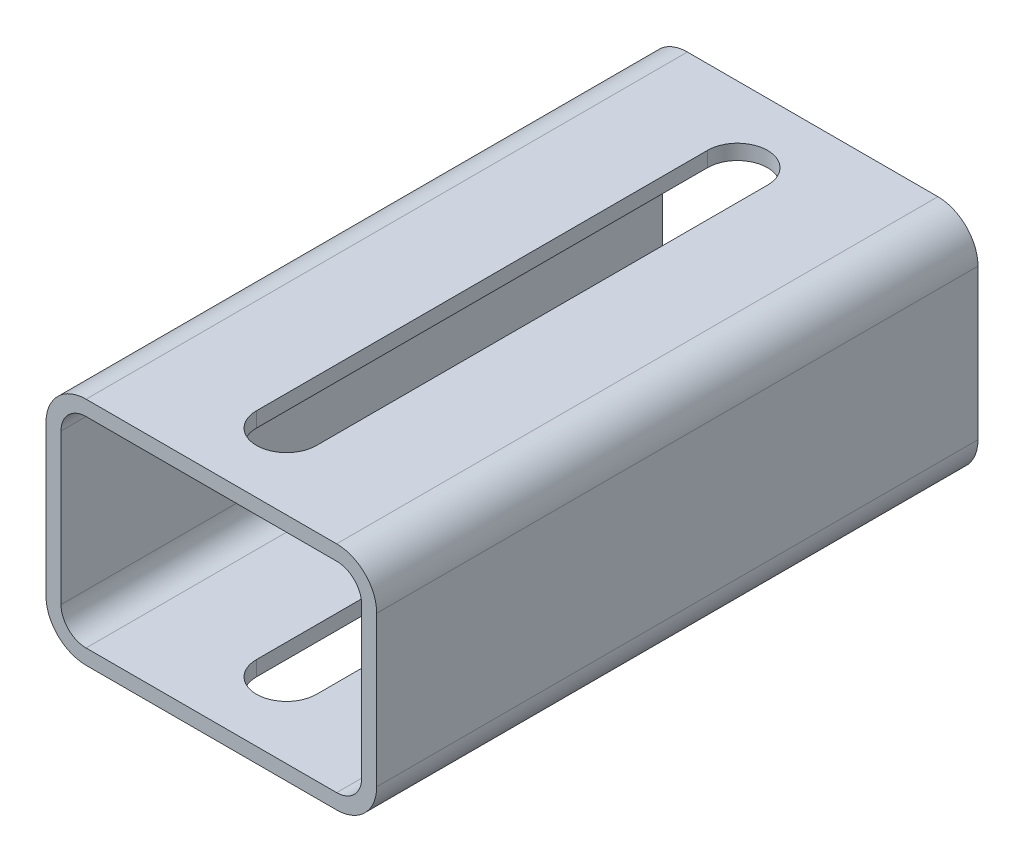
ISO-10303-21;
HEADER;
FILE_DESCRIPTION(('STEP AP214'),'2;1');
FILE_NAME('part.step','',(''),(''),'','','');
FILE_SCHEMA(('AUTOMOTIVE_DESIGN { 1 0 10303 214 1 1 1 1 }'));
ENDSEC;
DATA;
#1=APPLICATION_CONTEXT('core data for automotive mechanical design processes');
#2=APPLICATION_PROTOCOL_DEFINITION('international standard','automotive_design',2000,#1);
#3=PRODUCT_CONTEXT('',#1,'mechanical');
#4=PRODUCT('Part','Part','',(#3));
#5=PRODUCT_RELATED_PRODUCT_CATEGORY('part','',(#4));
#6=PRODUCT_DEFINITION_FORMATION('','',#4);
#7=PRODUCT_DEFINITION_CONTEXT('part definition',#1,'design');
#8=PRODUCT_DEFINITION('design','',#6,#7);
#9=PRODUCT_DEFINITION_SHAPE('','',#8);
#10=(LENGTH_UNIT() NAMED_UNIT(*) SI_UNIT(.MILLI.,.METRE.));
#11=(NAMED_UNIT(*) PLANE_ANGLE_UNIT() SI_UNIT($,.RADIAN.));
#12=(NAMED_UNIT(*) SI_UNIT($,.STERADIAN.) SOLID_ANGLE_UNIT());
#13=UNCERTAINTY_MEASURE_WITH_UNIT(LENGTH_MEASURE(1.E-05),#10,'distance_accuracy_value','');
#14=(GEOMETRIC_REPRESENTATION_CONTEXT(3) GLOBAL_UNCERTAINTY_ASSIGNED_CONTEXT((#13)) GLOBAL_UNIT_ASSIGNED_CONTEXT((#10,
#11,#12)) REPRESENTATION_CONTEXT('',''));
#15=CARTESIAN_POINT('',(0.,0.,0.));
#16=DIRECTION('',(0.,0.,1.));
#17=DIRECTION('',(1.,0.,0.));
#18=AXIS2_PLACEMENT_3D('',#15,#16,#17);
#19=CARTESIAN_POINT('',(-25.,-15.,60.));
#20=DIRECTION('',(0.,0.,1.));
#21=DIRECTION('',(1.,0.,0.));
#22=AXIS2_PLACEMENT_3D('',#19,#20,#21);
#23=PLANE('',#22);
#24=CARTESIAN_POINT('',(-25.,-15.,60.));
#25=DIRECTION('',(0.,0.,1.));
#26=DIRECTION('',(1.,0.,0.));
#27=AXIS2_PLACEMENT_3D('',#24,#25,#26);
#28=CIRCLE('',#27,8.);
#29=CARTESIAN_POINT('',(-33.,-15.,60.));
#30=VERTEX_POINT('',#29);
#31=CARTESIAN_POINT('',(-25.,-23.,60.));
#32=VERTEX_POINT('',#31);
#33=EDGE_CURVE('E403',#30,#32,#28,.T.);
#34=ORIENTED_EDGE('',*,*,#33,.T.);
#35=DIRECTION('',(1.,0.,0.));
#36=VECTOR('',#35,1.);
#37=CARTESIAN_POINT('',(25.,-23.,60.));
#38=LINE('',#37,#36);
#39=CARTESIAN_POINT('',(25.,-23.,60.));
#40=VERTEX_POINT('',#39);
#41=EDGE_CURVE('E407',#32,#40,#38,.T.);
#42=ORIENTED_EDGE('',*,*,#41,.T.);
#43=CARTESIAN_POINT('',(25.,-15.,60.));
#44=DIRECTION('',(0.,0.,1.));
#45=DIRECTION('',(1.,0.,0.));
#46=AXIS2_PLACEMENT_3D('',#43,#44,#45);
#47=CIRCLE('',#46,8.);
#48=CARTESIAN_POINT('',(33.,-15.,60.));
#49=VERTEX_POINT('',#48);
#50=EDGE_CURVE('E411',#40,#49,#47,.T.);
#51=ORIENTED_EDGE('',*,*,#50,.T.);
#52=DIRECTION('',(0.,1.,0.));
#53=VECTOR('',#52,1.);
#54=CARTESIAN_POINT('',(33.,-15.,60.));
#55=LINE('',#54,#53);
#56=CARTESIAN_POINT('',(33.,15.,60.));
#57=VERTEX_POINT('',#56);
#58=EDGE_CURVE('E414',#49,#57,#55,.T.);
#59=ORIENTED_EDGE('',*,*,#58,.T.);
#60=CARTESIAN_POINT('',(25.,15.,60.));
#61=DIRECTION('',(0.,0.,1.));
#62=DIRECTION('',(1.,0.,0.));
#63=AXIS2_PLACEMENT_3D('',#60,#61,#62);
#64=CIRCLE('',#63,8.);
#65=CARTESIAN_POINT('',(25.,23.,60.));
#66=VERTEX_POINT('',#65);
#67=EDGE_CURVE('E417',#57,#66,#64,.T.);
#68=ORIENTED_EDGE('',*,*,#67,.T.);
#69=DIRECTION('',(-1.,0.,0.));
#70=VECTOR('',#69,1.);
#71=CARTESIAN_POINT('',(25.,23.,60.));
#72=LINE('',#71,#70);
#73=CARTESIAN_POINT('',(-25.,23.,60.));
#74=VERTEX_POINT('',#73);
#75=EDGE_CURVE('E420',#66,#74,#72,.T.);
#76=ORIENTED_EDGE('',*,*,#75,.T.);
#77=CARTESIAN_POINT('',(-25.,15.,60.));
#78=DIRECTION('',(0.,0.,1.));
#79=DIRECTION('',(1.,0.,0.));
#80=AXIS2_PLACEMENT_3D('',#77,#78,#79);
#81=CIRCLE('',#80,8.);
#82=CARTESIAN_POINT('',(-33.,15.,60.));
#83=VERTEX_POINT('',#82);
#84=EDGE_CURVE('E423',#74,#83,#81,.T.);
#85=ORIENTED_EDGE('',*,*,#84,.T.);
#86=DIRECTION('',(0.,-1.,0.));
#87=VECTOR('',#86,1.);
#88=CARTESIAN_POINT('',(-33.,-15.,60.));
#89=LINE('',#88,#87);
#90=EDGE_CURVE('E426',#83,#30,#89,.T.);
#91=ORIENTED_EDGE('',*,*,#90,.T.);
#92=EDGE_LOOP('',(#34,#42,#51,#59,#68,#76,#85,#91));
#93=FACE_BOUND('',#92,.T.);
#94=DIRECTION('',(1.,0.,0.));
#95=VECTOR('',#94,1.);
#96=CARTESIAN_POINT('',(25.,-20.,60.));
#97=LINE('',#96,#95);
#98=CARTESIAN_POINT('',(-25.,-20.,60.));
#99=VERTEX_POINT('',#98);
#100=CARTESIAN_POINT('',(25.,-20.,60.));
#101=VERTEX_POINT('',#100);
#102=EDGE_CURVE('E323',#99,#101,#97,.T.);
#103=ORIENTED_EDGE('',*,*,#102,.F.);
#104=CARTESIAN_POINT('',(-25.,-15.,60.));
#105=DIRECTION('',(0.,0.,1.));
#106=DIRECTION('',(1.,0.,0.));
#107=AXIS2_PLACEMENT_3D('',#104,#105,#106);
#108=CIRCLE('',#107,5.);
#109=CARTESIAN_POINT('',(-30.,-15.,60.));
#110=VERTEX_POINT('',#109);
#111=EDGE_CURVE('E320',#110,#99,#108,.T.);
#112=ORIENTED_EDGE('',*,*,#111,.F.);
#113=DIRECTION('',(0.,-1.,0.));
#114=VECTOR('',#113,1.);
#115=CARTESIAN_POINT('',(-30.,-15.,60.));
#116=LINE('',#115,#114);
#117=CARTESIAN_POINT('',(-30.,15.,60.));
#118=VERTEX_POINT('',#117);
#119=EDGE_CURVE('E343',#118,#110,#116,.T.);
#120=ORIENTED_EDGE('',*,*,#119,.F.);
#121=CARTESIAN_POINT('',(-25.,15.,60.));
#122=DIRECTION('',(0.,0.,1.));
#123=DIRECTION('',(-1.,0.,0.));
#124=AXIS2_PLACEMENT_3D('',#121,#122,#123);
#125=CIRCLE('',#124,5.);
#126=CARTESIAN_POINT('',(-25.,20.,60.));
#127=VERTEX_POINT('',#126);
#128=EDGE_CURVE('E339',#127,#118,#125,.T.);
#129=ORIENTED_EDGE('',*,*,#128,.F.);
#130=DIRECTION('',(-1.,0.,0.));
#131=VECTOR('',#130,1.);
#132=CARTESIAN_POINT('',(25.,20.,60.));
#133=LINE('',#132,#131);
#134=CARTESIAN_POINT('',(25.,20.,60.));
#135=VERTEX_POINT('',#134);
#136=EDGE_CURVE('E336',#135,#127,#133,.T.);
#137=ORIENTED_EDGE('',*,*,#136,.F.);
#138=CARTESIAN_POINT('',(25.,15.,60.));
#139=DIRECTION('',(0.,0.,1.));
#140=DIRECTION('',(1.,0.,0.));
#141=AXIS2_PLACEMENT_3D('',#138,#139,#140);
#142=CIRCLE('',#141,5.);
#143=CARTESIAN_POINT('',(30.,15.,60.));
#144=VERTEX_POINT('',#143);
#145=EDGE_CURVE('E333',#144,#135,#142,.T.);
#146=ORIENTED_EDGE('',*,*,#145,.F.);
#147=DIRECTION('',(0.,1.,0.));
#148=VECTOR('',#147,1.);
#149=CARTESIAN_POINT('',(30.,-15.,60.));
#150=LINE('',#149,#148);
#151=CARTESIAN_POINT('',(30.,-15.,60.));
#152=VERTEX_POINT('',#151);
#153=EDGE_CURVE('E330',#152,#144,#150,.T.);
#154=ORIENTED_EDGE('',*,*,#153,.F.);
#155=CARTESIAN_POINT('',(25.,-15.,60.));
#156=DIRECTION('',(0.,0.,1.));
#157=DIRECTION('',(1.,0.,0.));
#158=AXIS2_PLACEMENT_3D('',#155,#156,#157);
#159=CIRCLE('',#158,5.);
#160=EDGE_CURVE('E327',#101,#152,#159,.T.);
#161=ORIENTED_EDGE('',*,*,#160,.F.);
#162=EDGE_LOOP('',(#103,#112,#120,#129,#137,#146,#154,#161));
#163=FACE_BOUND('',#162,.T.);
#164=ADVANCED_FACE('F87',(#93,#163),#23,.T.);
#165=CARTESIAN_POINT('',(-25.,-15.,-60.));
#166=DIRECTION('',(0.,0.,1.));
#167=DIRECTION('',(1.,0.,0.));
#168=AXIS2_PLACEMENT_3D('',#165,#166,#167);
#169=PLANE('',#168);
#170=CARTESIAN_POINT('',(-25.,-15.,-60.));
#171=DIRECTION('',(0.,0.,1.));
#172=DIRECTION('',(1.,0.,0.));
#173=AXIS2_PLACEMENT_3D('',#170,#171,#172);
#174=CIRCLE('',#173,8.);
#175=CARTESIAN_POINT('',(-33.,-15.,-60.));
#176=VERTEX_POINT('',#175);
#177=CARTESIAN_POINT('',(-25.,-23.,-60.));
#178=VERTEX_POINT('',#177);
#179=EDGE_CURVE('E402',#176,#178,#174,.T.);
#180=ORIENTED_EDGE('',*,*,#179,.F.);
#181=DIRECTION('',(0.,-1.,0.));
#182=VECTOR('',#181,1.);
#183=CARTESIAN_POINT('',(-33.,-15.,-60.));
#184=LINE('',#183,#182);
#185=CARTESIAN_POINT('',(-33.,15.,-60.));
#186=VERTEX_POINT('',#185);
#187=EDGE_CURVE('E408',#186,#176,#184,.T.);
#188=ORIENTED_EDGE('',*,*,#187,.F.);
#189=CARTESIAN_POINT('',(-25.,15.,-60.));
#190=DIRECTION('',(0.,0.,1.));
#191=DIRECTION('',(1.,0.,0.));
#192=AXIS2_PLACEMENT_3D('',#189,#190,#191);
#193=CIRCLE('',#192,8.);
#194=CARTESIAN_POINT('',(-25.,23.,-60.));
#195=VERTEX_POINT('',#194);
#196=EDGE_CURVE('E448',#195,#186,#193,.T.);
#197=ORIENTED_EDGE('',*,*,#196,.F.);
#198=DIRECTION('',(-1.,0.,0.));
#199=VECTOR('',#198,1.);
#200=CARTESIAN_POINT('',(25.,23.,-60.));
#201=LINE('',#200,#199);
#202=CARTESIAN_POINT('',(25.,23.,-60.));
#203=VERTEX_POINT('',#202);
#204=EDGE_CURVE('E445',#203,#195,#201,.T.);
#205=ORIENTED_EDGE('',*,*,#204,.F.);
#206=CARTESIAN_POINT('',(25.,15.,-60.));
#207=DIRECTION('',(0.,0.,1.));
#208=DIRECTION('',(1.,0.,0.));
#209=AXIS2_PLACEMENT_3D('',#206,#207,#208);
#210=CIRCLE('',#209,8.);
#211=CARTESIAN_POINT('',(33.,15.,-60.));
#212=VERTEX_POINT('',#211);
#213=EDGE_CURVE('E442',#212,#203,#210,.T.);
#214=ORIENTED_EDGE('',*,*,#213,.F.);
#215=DIRECTION('',(0.,1.,0.));
#216=VECTOR('',#215,1.);
#217=CARTESIAN_POINT('',(33.,-15.,-60.));
#218=LINE('',#217,#216);
#219=CARTESIAN_POINT('',(33.,-15.,-60.));
#220=VERTEX_POINT('',#219);
#221=EDGE_CURVE('E439',#220,#212,#218,.T.);
#222=ORIENTED_EDGE('',*,*,#221,.F.);
#223=CARTESIAN_POINT('',(25.,-15.,-60.));
#224=DIRECTION('',(0.,0.,1.));
#225=DIRECTION('',(1.,0.,0.));
#226=AXIS2_PLACEMENT_3D('',#223,#224,#225);
#227=CIRCLE('',#226,8.);
#228=CARTESIAN_POINT('',(25.,-23.,-60.));
#229=VERTEX_POINT('',#228);
#230=EDGE_CURVE('E436',#229,#220,#227,.T.);
#231=ORIENTED_EDGE('',*,*,#230,.F.);
#232=DIRECTION('',(1.,0.,0.));
#233=VECTOR('',#232,1.);
#234=CARTESIAN_POINT('',(25.,-23.,-60.));
#235=LINE('',#234,#233);
#236=EDGE_CURVE('E433',#178,#229,#235,.T.);
#237=ORIENTED_EDGE('',*,*,#236,.F.);
#238=EDGE_LOOP('',(#180,#188,#197,#205,#214,#222,#231,#237));
#239=FACE_BOUND('',#238,.T.);
#240=CARTESIAN_POINT('',(-25.,-15.,-60.));
#241=DIRECTION('',(0.,0.,1.));
#242=DIRECTION('',(1.,0.,0.));
#243=AXIS2_PLACEMENT_3D('',#240,#241,#242);
#244=CIRCLE('',#243,5.);
#245=CARTESIAN_POINT('',(-30.,-15.,-60.));
#246=VERTEX_POINT('',#245);
#247=CARTESIAN_POINT('',(-25.,-20.,-60.));
#248=VERTEX_POINT('',#247);
#249=EDGE_CURVE('E319',#246,#248,#244,.T.);
#250=ORIENTED_EDGE('',*,*,#249,.T.);
#251=DIRECTION('',(1.,0.,0.));
#252=VECTOR('',#251,1.);
#253=CARTESIAN_POINT('',(25.,-20.,-60.));
#254=LINE('',#253,#252);
#255=CARTESIAN_POINT('',(25.,-20.,-60.));
#256=VERTEX_POINT('',#255);
#257=EDGE_CURVE('E350',#248,#256,#254,.T.);
#258=ORIENTED_EDGE('',*,*,#257,.T.);
#259=CARTESIAN_POINT('',(25.,-15.,-60.));
#260=DIRECTION('',(0.,0.,1.));
#261=DIRECTION('',(1.,0.,0.));
#262=AXIS2_PLACEMENT_3D('',#259,#260,#261);
#263=CIRCLE('',#262,5.);
#264=CARTESIAN_POINT('',(30.,-15.,-60.));
#265=VERTEX_POINT('',#264);
#266=EDGE_CURVE('E354',#256,#265,#263,.T.);
#267=ORIENTED_EDGE('',*,*,#266,.T.);
#268=DIRECTION('',(0.,1.,0.));
#269=VECTOR('',#268,1.);
#270=CARTESIAN_POINT('',(30.,-15.,-60.));
#271=LINE('',#270,#269);
#272=CARTESIAN_POINT('',(30.,15.,-60.));
#273=VERTEX_POINT('',#272);
#274=EDGE_CURVE('E358',#265,#273,#271,.T.);
#275=ORIENTED_EDGE('',*,*,#274,.T.);
#276=CARTESIAN_POINT('',(25.,15.,-60.));
#277=DIRECTION('',(0.,0.,1.));
#278=DIRECTION('',(1.,0.,0.));
#279=AXIS2_PLACEMENT_3D('',#276,#277,#278);
#280=CIRCLE('',#279,5.);
#281=CARTESIAN_POINT('',(25.,20.,-60.));
#282=VERTEX_POINT('',#281);
#283=EDGE_CURVE('E362',#273,#282,#280,.T.);
#284=ORIENTED_EDGE('',*,*,#283,.T.);
#285=DIRECTION('',(-1.,0.,0.));
#286=VECTOR('',#285,1.);
#287=CARTESIAN_POINT('',(25.,20.,-60.));
#288=LINE('',#287,#286);
#289=CARTESIAN_POINT('',(-25.,20.,-60.));
#290=VERTEX_POINT('',#289);
#291=EDGE_CURVE('E366',#282,#290,#288,.T.);
#292=ORIENTED_EDGE('',*,*,#291,.T.);
#293=CARTESIAN_POINT('',(-25.,15.,-60.));
#294=DIRECTION('',(0.,0.,1.));
#295=DIRECTION('',(-1.,0.,0.));
#296=AXIS2_PLACEMENT_3D('',#293,#294,#295);
#297=CIRCLE('',#296,5.);
#298=CARTESIAN_POINT('',(-30.,15.,-60.));
#299=VERTEX_POINT('',#298);
#300=EDGE_CURVE('E370',#290,#299,#297,.T.);
#301=ORIENTED_EDGE('',*,*,#300,.T.);
#302=DIRECTION('',(0.,-1.,0.));
#303=VECTOR('',#302,1.);
#304=CARTESIAN_POINT('',(-30.,-15.,-60.));
#305=LINE('',#304,#303);
#306=EDGE_CURVE('E324',#299,#246,#305,.T.);
#307=ORIENTED_EDGE('',*,*,#306,.T.);
#308=EDGE_LOOP('',(#250,#258,#267,#275,#284,#292,#301,#307));
#309=FACE_BOUND('',#308,.T.);
#310=ADVANCED_FACE('F533',(#239,#309),#169,.F.);
#311=CARTESIAN_POINT('',(-25.,-15.,60.));
#312=DIRECTION('',(0.,0.,-1.));
#313=DIRECTION('',(-1.,0.,0.));
#314=AXIS2_PLACEMENT_3D('',#311,#312,#313);
#315=CYLINDRICAL_SURFACE('',#314,8.);
#316=ORIENTED_EDGE('',*,*,#179,.T.);
#317=DIRECTION('',(0.,0.,-1.));
#318=VECTOR('',#317,1.);
#319=CARTESIAN_POINT('',(-25.,-23.,60.));
#320=LINE('',#319,#318);
#321=EDGE_CURVE('E480',#32,#178,#320,.T.);
#322=ORIENTED_EDGE('',*,*,#321,.F.);
#323=ORIENTED_EDGE('',*,*,#33,.F.);
#324=DIRECTION('',(0.,0.,-1.));
#325=VECTOR('',#324,1.);
#326=CARTESIAN_POINT('',(-33.,-15.,60.));
#327=LINE('',#326,#325);
#328=EDGE_CURVE('E429',#30,#176,#327,.T.);
#329=ORIENTED_EDGE('',*,*,#328,.T.);
#330=EDGE_LOOP('',(#316,#322,#323,#329));
#331=FACE_BOUND('',#330,.T.);
#332=ADVANCED_FACE('F89',(#331),#315,.T.);
#333=CARTESIAN_POINT('',(25.,-23.,60.));
#334=DIRECTION('',(0.,1.,0.));
#335=DIRECTION('',(-1.,0.,0.));
#336=AXIS2_PLACEMENT_3D('',#333,#334,#335);
#337=PLANE('',#336);
#338=DIRECTION('',(0.,0.,1.));
#339=VECTOR('',#338,1.);
#340=CARTESIAN_POINT('',(-6.,-23.,45.));
#341=LINE('',#340,#339);
#342=CARTESIAN_POINT('',(-6.,-23.,-45.));
#343=VERTEX_POINT('',#342);
#344=CARTESIAN_POINT('',(-6.,-23.,45.));
#345=VERTEX_POINT('',#344);
#346=EDGE_CURVE('E275',#343,#345,#341,.T.);
#347=ORIENTED_EDGE('',*,*,#346,.T.);
#348=CARTESIAN_POINT('',(0.,-23.,45.));
#349=DIRECTION('',(0.,1.,0.));
#350=DIRECTION('',(-1.,0.,0.));
#351=AXIS2_PLACEMENT_3D('',#348,#349,#350);
#352=CIRCLE('',#351,6.);
#353=CARTESIAN_POINT('',(6.,-23.,45.));
#354=VERTEX_POINT('',#353);
#355=EDGE_CURVE('E255',#345,#354,#352,.T.);
#356=ORIENTED_EDGE('',*,*,#355,.T.);
#357=DIRECTION('',(0.,0.,-1.));
#358=VECTOR('',#357,1.);
#359=CARTESIAN_POINT('',(6.,-23.,45.));
#360=LINE('',#359,#358);
#361=CARTESIAN_POINT('',(6.,-23.,-45.));
#362=VERTEX_POINT('',#361);
#363=EDGE_CURVE('E266',#354,#362,#360,.T.);
#364=ORIENTED_EDGE('',*,*,#363,.T.);
#365=CARTESIAN_POINT('',(0.,-23.,-45.));
#366=DIRECTION('',(0.,1.,0.));
#367=DIRECTION('',(-1.,0.,0.));
#368=AXIS2_PLACEMENT_3D('',#365,#366,#367);
#369=CIRCLE('',#368,6.);
#370=EDGE_CURVE('E103',#362,#343,#369,.T.);
#371=ORIENTED_EDGE('',*,*,#370,.T.);
#372=EDGE_LOOP('',(#347,#356,#364,#371));
#373=FACE_BOUND('',#372,.T.);
#374=ORIENTED_EDGE('',*,*,#236,.T.);
#375=DIRECTION('',(0.,0.,-1.));
#376=VECTOR('',#375,1.);
#377=CARTESIAN_POINT('',(25.,-23.,60.));
#378=LINE('',#377,#376);
#379=EDGE_CURVE('E476',#40,#229,#378,.T.);
#380=ORIENTED_EDGE('',*,*,#379,.F.);
#381=ORIENTED_EDGE('',*,*,#41,.F.);
#382=ORIENTED_EDGE('',*,*,#321,.T.);
#383=EDGE_LOOP('',(#374,#380,#381,#382));
#384=FACE_BOUND('',#383,.T.);
#385=ADVANCED_FACE('F272',(#373,#384),#337,.F.);
#386=CARTESIAN_POINT('',(25.,-15.,60.));
#387=DIRECTION('',(0.,0.,-1.));
#388=DIRECTION('',(-1.,0.,0.));
#389=AXIS2_PLACEMENT_3D('',#386,#387,#388);
#390=CYLINDRICAL_SURFACE('',#389,8.);
#391=ORIENTED_EDGE('',*,*,#230,.T.);
#392=DIRECTION('',(0.,0.,-1.));
#393=VECTOR('',#392,1.);
#394=CARTESIAN_POINT('',(33.,-15.,60.));
#395=LINE('',#394,#393);
#396=EDGE_CURVE('E472',#49,#220,#395,.T.);
#397=ORIENTED_EDGE('',*,*,#396,.F.);
#398=ORIENTED_EDGE('',*,*,#50,.F.);
#399=ORIENTED_EDGE('',*,*,#379,.T.);
#400=EDGE_LOOP('',(#391,#397,#398,#399));
#401=FACE_BOUND('',#400,.T.);
#402=ADVANCED_FACE('F556',(#401),#390,.T.);
#403=CARTESIAN_POINT('',(33.,-15.,60.));
#404=DIRECTION('',(-1.,0.,0.));
#405=DIRECTION('',(0.,-1.,0.));
#406=AXIS2_PLACEMENT_3D('',#403,#404,#405);
#407=PLANE('',#406);
#408=ORIENTED_EDGE('',*,*,#221,.T.);
#409=DIRECTION('',(0.,0.,-1.));
#410=VECTOR('',#409,1.);
#411=CARTESIAN_POINT('',(33.,15.,60.));
#412=LINE('',#411,#410);
#413=EDGE_CURVE('E468',#57,#212,#412,.T.);
#414=ORIENTED_EDGE('',*,*,#413,.F.);
#415=ORIENTED_EDGE('',*,*,#58,.F.);
#416=ORIENTED_EDGE('',*,*,#396,.T.);
#417=EDGE_LOOP('',(#408,#414,#415,#416));
#418=FACE_BOUND('',#417,.T.);
#419=ADVANCED_FACE('F552',(#418),#407,.F.);
#420=CARTESIAN_POINT('',(25.,15.,60.));
#421=DIRECTION('',(0.,0.,-1.));
#422=DIRECTION('',(-1.,0.,0.));
#423=AXIS2_PLACEMENT_3D('',#420,#421,#422);
#424=CYLINDRICAL_SURFACE('',#423,8.);
#425=ORIENTED_EDGE('',*,*,#213,.T.);
#426=DIRECTION('',(0.,0.,-1.));
#427=VECTOR('',#426,1.);
#428=CARTESIAN_POINT('',(25.,23.,60.));
#429=LINE('',#428,#427);
#430=EDGE_CURVE('E464',#66,#203,#429,.T.);
#431=ORIENTED_EDGE('',*,*,#430,.F.);
#432=ORIENTED_EDGE('',*,*,#67,.F.);
#433=ORIENTED_EDGE('',*,*,#413,.T.);
#434=EDGE_LOOP('',(#425,#431,#432,#433));
#435=FACE_BOUND('',#434,.T.);
#436=ADVANCED_FACE('F519',(#435),#424,.T.);
#437=CARTESIAN_POINT('',(25.,23.,60.));
#438=DIRECTION('',(0.,-1.,0.));
#439=DIRECTION('',(1.,0.,0.));
#440=AXIS2_PLACEMENT_3D('',#437,#438,#439);
#441=PLANE('',#440);
#442=DIRECTION('',(0.,0.,-1.));
#443=VECTOR('',#442,1.);
#444=CARTESIAN_POINT('',(5.99999999999999,23.,45.));
#445=LINE('',#444,#443);
#446=CARTESIAN_POINT('',(5.99999999999999,23.,45.));
#447=VERTEX_POINT('',#446);
#448=CARTESIAN_POINT('',(5.99999999999999,23.,-45.));
#449=VERTEX_POINT('',#448);
#450=EDGE_CURVE('E290',#447,#449,#445,.T.);
#451=ORIENTED_EDGE('',*,*,#450,.F.);
#452=CARTESIAN_POINT('',(0.,23.,45.));
#453=DIRECTION('',(0.,1.,0.));
#454=DIRECTION('',(-1.,0.,0.));
#455=AXIS2_PLACEMENT_3D('',#452,#453,#454);
#456=CIRCLE('',#455,6.);
#457=CARTESIAN_POINT('',(-6.00000000000001,23.,45.));
#458=VERTEX_POINT('',#457);
#459=EDGE_CURVE('E111',#458,#447,#456,.T.);
#460=ORIENTED_EDGE('',*,*,#459,.F.);
#461=DIRECTION('',(0.,0.,1.));
#462=VECTOR('',#461,1.);
#463=CARTESIAN_POINT('',(-6.00000000000001,23.,45.));
#464=LINE('',#463,#462);
#465=CARTESIAN_POINT('',(-6.00000000000001,23.,-45.));
#466=VERTEX_POINT('',#465);
#467=EDGE_CURVE('E277',#466,#458,#464,.T.);
#468=ORIENTED_EDGE('',*,*,#467,.F.);
#469=CARTESIAN_POINT('',(0.,23.,-45.));
#470=DIRECTION('',(0.,1.,0.));
#471=DIRECTION('',(-1.,0.,0.));
#472=AXIS2_PLACEMENT_3D('',#469,#470,#471);
#473=CIRCLE('',#472,6.);
#474=EDGE_CURVE('E281',#449,#466,#473,.T.);
#475=ORIENTED_EDGE('',*,*,#474,.F.);
#476=EDGE_LOOP('',(#451,#460,#468,#475));
#477=FACE_BOUND('',#476,.T.);
#478=ORIENTED_EDGE('',*,*,#204,.T.);
#479=DIRECTION('',(0.,0.,-1.));
#480=VECTOR('',#479,1.);
#481=CARTESIAN_POINT('',(-25.,23.,60.));
#482=LINE('',#481,#480);
#483=EDGE_CURVE('E460',#74,#195,#482,.T.);
#484=ORIENTED_EDGE('',*,*,#483,.F.);
#485=ORIENTED_EDGE('',*,*,#75,.F.);
#486=ORIENTED_EDGE('',*,*,#430,.T.);
#487=EDGE_LOOP('',(#478,#484,#485,#486));
#488=FACE_BOUND('',#487,.T.);
#489=ADVANCED_FACE('F515',(#477,#488),#441,.F.);
#490=CARTESIAN_POINT('',(-25.,15.,60.));
#491=DIRECTION('',(0.,0.,-1.));
#492=DIRECTION('',(-1.,0.,0.));
#493=AXIS2_PLACEMENT_3D('',#490,#491,#492);
#494=CYLINDRICAL_SURFACE('',#493,8.);
#495=ORIENTED_EDGE('',*,*,#196,.T.);
#496=DIRECTION('',(0.,0.,-1.));
#497=VECTOR('',#496,1.);
#498=CARTESIAN_POINT('',(-33.,15.,60.));
#499=LINE('',#498,#497);
#500=EDGE_CURVE('E456',#83,#186,#499,.T.);
#501=ORIENTED_EDGE('',*,*,#500,.F.);
#502=ORIENTED_EDGE('',*,*,#84,.F.);
#503=ORIENTED_EDGE('',*,*,#483,.T.);
#504=EDGE_LOOP('',(#495,#501,#502,#503));
#505=FACE_BOUND('',#504,.T.);
#506=ADVANCED_FACE('F518',(#505),#494,.T.);
#507=CARTESIAN_POINT('',(-33.,-15.,60.));
#508=DIRECTION('',(1.,0.,0.));
#509=DIRECTION('',(0.,0.,-1.));
#510=AXIS2_PLACEMENT_3D('',#507,#508,#509);
#511=PLANE('',#510);
#512=ORIENTED_EDGE('',*,*,#187,.T.);
#513=ORIENTED_EDGE('',*,*,#328,.F.);
#514=ORIENTED_EDGE('',*,*,#90,.F.);
#515=ORIENTED_EDGE('',*,*,#500,.T.);
#516=EDGE_LOOP('',(#512,#513,#514,#515));
#517=FACE_BOUND('',#516,.T.);
#518=ADVANCED_FACE('F537',(#517),#511,.F.);
#519=CARTESIAN_POINT('',(-25.,-15.,60.));
#520=DIRECTION('',(0.,0.,-1.));
#521=DIRECTION('',(-1.,0.,0.));
#522=AXIS2_PLACEMENT_3D('',#519,#520,#521);
#523=CYLINDRICAL_SURFACE('',#522,5.);
#524=ORIENTED_EDGE('',*,*,#249,.F.);
#525=DIRECTION('',(0.,0.,-1.));
#526=VECTOR('',#525,1.);
#527=CARTESIAN_POINT('',(-30.,-15.,60.));
#528=LINE('',#527,#526);
#529=EDGE_CURVE('E346',#110,#246,#528,.T.);
#530=ORIENTED_EDGE('',*,*,#529,.F.);
#531=ORIENTED_EDGE('',*,*,#111,.T.);
#532=DIRECTION('',(0.,0.,-1.));
#533=VECTOR('',#532,1.);
#534=CARTESIAN_POINT('',(-25.,-20.,60.));
#535=LINE('',#534,#533);
#536=EDGE_CURVE('E398',#99,#248,#535,.T.);
#537=ORIENTED_EDGE('',*,*,#536,.T.);
#538=EDGE_LOOP('',(#524,#530,#531,#537));
#539=FACE_BOUND('',#538,.T.);
#540=ADVANCED_FACE('F570',(#539),#523,.F.);
#541=CARTESIAN_POINT('',(25.,-20.,60.));
#542=DIRECTION('',(0.,1.,0.));
#543=DIRECTION('',(-1.,0.,0.));
#544=AXIS2_PLACEMENT_3D('',#541,#542,#543);
#545=PLANE('',#544);
#546=CARTESIAN_POINT('',(0.,-20.,45.));
#547=DIRECTION('',(0.,1.,0.));
#548=DIRECTION('',(-1.,0.,0.));
#549=AXIS2_PLACEMENT_3D('',#546,#547,#548);
#550=CIRCLE('',#549,6.);
#551=CARTESIAN_POINT('',(-6.,-20.,45.));
#552=VERTEX_POINT('',#551);
#553=CARTESIAN_POINT('',(6.,-20.,45.));
#554=VERTEX_POINT('',#553);
#555=EDGE_CURVE('E258',#552,#554,#550,.T.);
#556=ORIENTED_EDGE('',*,*,#555,.F.);
#557=DIRECTION('',(0.,0.,1.));
#558=VECTOR('',#557,1.);
#559=CARTESIAN_POINT('',(-6.,-20.,60.));
#560=LINE('',#559,#558);
#561=CARTESIAN_POINT('',(-6.,-20.,-45.));
#562=VERTEX_POINT('',#561);
#563=EDGE_CURVE('E314',#562,#552,#560,.T.);
#564=ORIENTED_EDGE('',*,*,#563,.F.);
#565=CARTESIAN_POINT('',(0.,-20.,-45.));
#566=DIRECTION('',(0.,1.,0.));
#567=DIRECTION('',(-1.,0.,0.));
#568=AXIS2_PLACEMENT_3D('',#565,#566,#567);
#569=CIRCLE('',#568,6.);
#570=CARTESIAN_POINT('',(6.,-20.,-45.));
#571=VERTEX_POINT('',#570);
#572=EDGE_CURVE('E311',#571,#562,#569,.T.);
#573=ORIENTED_EDGE('',*,*,#572,.F.);
#574=DIRECTION('',(0.,0.,-1.));
#575=VECTOR('',#574,1.);
#576=CARTESIAN_POINT('',(6.,-20.,60.));
#577=LINE('',#576,#575);
#578=EDGE_CURVE('E300',#554,#571,#577,.T.);
#579=ORIENTED_EDGE('',*,*,#578,.F.);
#580=EDGE_LOOP('',(#556,#564,#573,#579));
#581=FACE_BOUND('',#580,.T.);
#582=ORIENTED_EDGE('',*,*,#257,.F.);
#583=ORIENTED_EDGE('',*,*,#536,.F.);
#584=ORIENTED_EDGE('',*,*,#102,.T.);
#585=DIRECTION('',(0.,0.,-1.));
#586=VECTOR('',#585,1.);
#587=CARTESIAN_POINT('',(25.,-20.,60.));
#588=LINE('',#587,#586);
#589=EDGE_CURVE('E395',#101,#256,#588,.T.);
#590=ORIENTED_EDGE('',*,*,#589,.T.);
#591=EDGE_LOOP('',(#582,#583,#584,#590));
#592=FACE_BOUND('',#591,.T.);
#593=ADVANCED_FACE('F607',(#581,#592),#545,.T.);
#594=CARTESIAN_POINT('',(25.,-15.,60.));
#595=DIRECTION('',(0.,0.,-1.));
#596=DIRECTION('',(-1.,0.,0.));
#597=AXIS2_PLACEMENT_3D('',#594,#595,#596);
#598=CYLINDRICAL_SURFACE('',#597,5.);
#599=ORIENTED_EDGE('',*,*,#266,.F.);
#600=ORIENTED_EDGE('',*,*,#589,.F.);
#601=ORIENTED_EDGE('',*,*,#160,.T.);
#602=DIRECTION('',(0.,0.,-1.));
#603=VECTOR('',#602,1.);
#604=CARTESIAN_POINT('',(30.,-15.,60.));
#605=LINE('',#604,#603);
#606=EDGE_CURVE('E392',#152,#265,#605,.T.);
#607=ORIENTED_EDGE('',*,*,#606,.T.);
#608=EDGE_LOOP('',(#599,#600,#601,#607));
#609=FACE_BOUND('',#608,.T.);
#610=ADVANCED_FACE('F614',(#609),#598,.F.);
#611=CARTESIAN_POINT('',(30.,-15.,60.));
#612=DIRECTION('',(-1.,0.,0.));
#613=DIRECTION('',(0.,-1.,0.));
#614=AXIS2_PLACEMENT_3D('',#611,#612,#613);
#615=PLANE('',#614);
#616=ORIENTED_EDGE('',*,*,#274,.F.);
#617=ORIENTED_EDGE('',*,*,#606,.F.);
#618=ORIENTED_EDGE('',*,*,#153,.T.);
#619=DIRECTION('',(0.,0.,-1.));
#620=VECTOR('',#619,1.);
#621=CARTESIAN_POINT('',(30.,15.,60.));
#622=LINE('',#621,#620);
#623=EDGE_CURVE('E389',#144,#273,#622,.T.);
#624=ORIENTED_EDGE('',*,*,#623,.T.);
#625=EDGE_LOOP('',(#616,#617,#618,#624));
#626=FACE_BOUND('',#625,.T.);
#627=ADVANCED_FACE('F621',(#626),#615,.T.);
#628=CARTESIAN_POINT('',(25.,15.,60.));
#629=DIRECTION('',(0.,0.,-1.));
#630=DIRECTION('',(-1.,0.,0.));
#631=AXIS2_PLACEMENT_3D('',#628,#629,#630);
#632=CYLINDRICAL_SURFACE('',#631,5.);
#633=ORIENTED_EDGE('',*,*,#283,.F.);
#634=ORIENTED_EDGE('',*,*,#623,.F.);
#635=ORIENTED_EDGE('',*,*,#145,.T.);
#636=DIRECTION('',(0.,0.,-1.));
#637=VECTOR('',#636,1.);
#638=CARTESIAN_POINT('',(25.,20.,60.));
#639=LINE('',#638,#637);
#640=EDGE_CURVE('E386',#135,#282,#639,.T.);
#641=ORIENTED_EDGE('',*,*,#640,.T.);
#642=EDGE_LOOP('',(#633,#634,#635,#641));
#643=FACE_BOUND('',#642,.T.);
#644=ADVANCED_FACE('F629',(#643),#632,.F.);
#645=CARTESIAN_POINT('',(25.,20.,60.));
#646=DIRECTION('',(0.,-1.,0.));
#647=DIRECTION('',(1.,0.,0.));
#648=AXIS2_PLACEMENT_3D('',#645,#646,#647);
#649=PLANE('',#648);
#650=CARTESIAN_POINT('',(0.,20.,45.));
#651=DIRECTION('',(0.,-1.,0.));
#652=DIRECTION('',(1.,0.,0.));
#653=AXIS2_PLACEMENT_3D('',#650,#651,#652);
#654=CIRCLE('',#653,6.);
#655=CARTESIAN_POINT('',(5.99999999999999,20.,45.));
#656=VERTEX_POINT('',#655);
#657=CARTESIAN_POINT('',(-6.00000000000001,20.,45.));
#658=VERTEX_POINT('',#657);
#659=EDGE_CURVE('E12',#656,#658,#654,.T.);
#660=ORIENTED_EDGE('',*,*,#659,.F.);
#661=DIRECTION('',(0.,0.,1.));
#662=VECTOR('',#661,1.);
#663=CARTESIAN_POINT('',(5.99999999999999,20.,60.));
#664=LINE('',#663,#662);
#665=CARTESIAN_POINT('',(5.99999999999999,20.,-45.));
#666=VERTEX_POINT('',#665);
#667=EDGE_CURVE('E484',#666,#656,#664,.T.);
#668=ORIENTED_EDGE('',*,*,#667,.F.);
#669=CARTESIAN_POINT('',(0.,20.,-45.));
#670=DIRECTION('',(0.,-1.,0.));
#671=DIRECTION('',(1.,0.,0.));
#672=AXIS2_PLACEMENT_3D('',#669,#670,#671);
#673=CIRCLE('',#672,6.);
#674=CARTESIAN_POINT('',(-6.00000000000001,20.,-45.));
#675=VERTEX_POINT('',#674);
#676=EDGE_CURVE('E487',#675,#666,#673,.T.);
#677=ORIENTED_EDGE('',*,*,#676,.F.);
#678=DIRECTION('',(0.,0.,-1.));
#679=VECTOR('',#678,1.);
#680=CARTESIAN_POINT('',(-6.00000000000001,20.,60.));
#681=LINE('',#680,#679);
#682=EDGE_CURVE('E96',#658,#675,#681,.T.);
#683=ORIENTED_EDGE('',*,*,#682,.F.);
#684=EDGE_LOOP('',(#660,#668,#677,#683));
#685=FACE_BOUND('',#684,.T.);
#686=ORIENTED_EDGE('',*,*,#291,.F.);
#687=ORIENTED_EDGE('',*,*,#640,.F.);
#688=ORIENTED_EDGE('',*,*,#136,.T.);
#689=DIRECTION('',(0.,0.,-1.));
#690=VECTOR('',#689,1.);
#691=CARTESIAN_POINT('',(-25.,20.,60.));
#692=LINE('',#691,#690);
#693=EDGE_CURVE('E383',#127,#290,#692,.T.);
#694=ORIENTED_EDGE('',*,*,#693,.T.);
#695=EDGE_LOOP('',(#686,#687,#688,#694));
#696=FACE_BOUND('',#695,.T.);
#697=ADVANCED_FACE('F505',(#685,#696),#649,.T.);
#698=CARTESIAN_POINT('',(-25.,15.,60.));
#699=DIRECTION('',(0.,0.,-1.));
#700=DIRECTION('',(-1.,0.,0.));
#701=AXIS2_PLACEMENT_3D('',#698,#699,#700);
#702=CYLINDRICAL_SURFACE('',#701,5.);
#703=ORIENTED_EDGE('',*,*,#300,.F.);
#704=ORIENTED_EDGE('',*,*,#693,.F.);
#705=ORIENTED_EDGE('',*,*,#128,.T.);
#706=DIRECTION('',(0.,0.,-1.));
#707=VECTOR('',#706,1.);
#708=CARTESIAN_POINT('',(-30.,15.,60.));
#709=LINE('',#708,#707);
#710=EDGE_CURVE('E380',#118,#299,#709,.T.);
#711=ORIENTED_EDGE('',*,*,#710,.T.);
#712=EDGE_LOOP('',(#703,#704,#705,#711));
#713=FACE_BOUND('',#712,.T.);
#714=ADVANCED_FACE('F644',(#713),#702,.F.);
#715=CARTESIAN_POINT('',(-30.,-15.,60.));
#716=DIRECTION('',(1.,0.,0.));
#717=DIRECTION('',(0.,0.,-1.));
#718=AXIS2_PLACEMENT_3D('',#715,#716,#717);
#719=PLANE('',#718);
#720=ORIENTED_EDGE('',*,*,#306,.F.);
#721=ORIENTED_EDGE('',*,*,#710,.F.);
#722=ORIENTED_EDGE('',*,*,#119,.T.);
#723=ORIENTED_EDGE('',*,*,#529,.T.);
#724=EDGE_LOOP('',(#720,#721,#722,#723));
#725=FACE_BOUND('',#724,.T.);
#726=ADVANCED_FACE('F651',(#725),#719,.T.);
#727=CARTESIAN_POINT('',(6.,-23.,45.));
#728=DIRECTION('',(1.,0.,0.));
#729=DIRECTION('',(0.,1.,0.));
#730=AXIS2_PLACEMENT_3D('',#727,#728,#729);
#731=PLANE('',#730);
#732=ORIENTED_EDGE('',*,*,#667,.T.);
#733=DIRECTION('',(0.,1.,0.));
#734=VECTOR('',#733,1.);
#735=CARTESIAN_POINT('',(6.,-23.,45.));
#736=LINE('',#735,#734);
#737=EDGE_CURVE('E263',#656,#447,#736,.T.);
#738=ORIENTED_EDGE('',*,*,#737,.T.);
#739=ORIENTED_EDGE('',*,*,#450,.T.);
#740=DIRECTION('',(0.,1.,0.));
#741=VECTOR('',#740,1.);
#742=CARTESIAN_POINT('',(6.,-23.,-45.));
#743=LINE('',#742,#741);
#744=EDGE_CURVE('E262',#666,#449,#743,.T.);
#745=ORIENTED_EDGE('',*,*,#744,.F.);
#746=EDGE_LOOP('',(#732,#738,#739,#745));
#747=FACE_BOUND('',#746,.T.);
#748=ADVANCED_FACE('F508',(#747),#731,.F.);
#749=CARTESIAN_POINT('',(0.,-23.,-45.));
#750=DIRECTION('',(0.,1.,0.));
#751=DIRECTION('',(-1.,0.,0.));
#752=AXIS2_PLACEMENT_3D('',#749,#750,#751);
#753=CYLINDRICAL_SURFACE('',#752,6.);
#754=ORIENTED_EDGE('',*,*,#676,.T.);
#755=ORIENTED_EDGE('',*,*,#744,.T.);
#756=ORIENTED_EDGE('',*,*,#474,.T.);
#757=DIRECTION('',(0.,1.,0.));
#758=VECTOR('',#757,1.);
#759=CARTESIAN_POINT('',(-6.,-23.,-45.));
#760=LINE('',#759,#758);
#761=EDGE_CURVE('E306',#675,#466,#760,.T.);
#762=ORIENTED_EDGE('',*,*,#761,.F.);
#763=EDGE_LOOP('',(#754,#755,#756,#762));
#764=FACE_BOUND('',#763,.T.);
#765=ADVANCED_FACE('F500',(#764),#753,.F.);
#766=CARTESIAN_POINT('',(-6.,-23.,45.));
#767=DIRECTION('',(-1.,0.,0.));
#768=DIRECTION('',(0.,-1.,0.));
#769=AXIS2_PLACEMENT_3D('',#766,#767,#768);
#770=PLANE('',#769);
#771=ORIENTED_EDGE('',*,*,#682,.T.);
#772=ORIENTED_EDGE('',*,*,#761,.T.);
#773=ORIENTED_EDGE('',*,*,#467,.T.);
#774=DIRECTION('',(0.,1.,0.));
#775=VECTOR('',#774,1.);
#776=CARTESIAN_POINT('',(-6.,-23.,45.));
#777=LINE('',#776,#775);
#778=EDGE_CURVE('E301',#658,#458,#777,.T.);
#779=ORIENTED_EDGE('',*,*,#778,.F.);
#780=EDGE_LOOP('',(#771,#772,#773,#779));
#781=FACE_BOUND('',#780,.T.);
#782=ADVANCED_FACE('F495',(#781),#770,.F.);
#783=CARTESIAN_POINT('',(0.,-23.,45.));
#784=DIRECTION('',(0.,1.,0.));
#785=DIRECTION('',(-1.,0.,0.));
#786=AXIS2_PLACEMENT_3D('',#783,#784,#785);
#787=CYLINDRICAL_SURFACE('',#786,6.);
#788=ORIENTED_EDGE('',*,*,#659,.T.);
#789=ORIENTED_EDGE('',*,*,#778,.T.);
#790=ORIENTED_EDGE('',*,*,#459,.T.);
#791=ORIENTED_EDGE('',*,*,#737,.F.);
#792=EDGE_LOOP('',(#788,#789,#790,#791));
#793=FACE_BOUND('',#792,.T.);
#794=ADVANCED_FACE('F510',(#793),#787,.F.);
#795=ORIENTED_EDGE('',*,*,#555,.T.);
#796=EDGE_CURVE('E250',#354,#554,#736,.T.);
#797=ORIENTED_EDGE('',*,*,#796,.F.);
#798=ORIENTED_EDGE('',*,*,#355,.F.);
#799=EDGE_CURVE('E297',#345,#552,#777,.T.);
#800=ORIENTED_EDGE('',*,*,#799,.T.);
#801=EDGE_LOOP('',(#795,#797,#798,#800));
#802=FACE_BOUND('',#801,.T.);
#803=ADVANCED_FACE('F252',(#802),#787,.F.);
#804=ORIENTED_EDGE('',*,*,#563,.T.);
#805=ORIENTED_EDGE('',*,*,#799,.F.);
#806=ORIENTED_EDGE('',*,*,#346,.F.);
#807=EDGE_CURVE('E302',#343,#562,#760,.T.);
#808=ORIENTED_EDGE('',*,*,#807,.T.);
#809=EDGE_LOOP('',(#804,#805,#806,#808));
#810=FACE_BOUND('',#809,.T.);
#811=ADVANCED_FACE('F679',(#810),#770,.F.);
#812=ORIENTED_EDGE('',*,*,#572,.T.);
#813=ORIENTED_EDGE('',*,*,#807,.F.);
#814=ORIENTED_EDGE('',*,*,#370,.F.);
#815=EDGE_CURVE('E268',#362,#571,#743,.T.);
#816=ORIENTED_EDGE('',*,*,#815,.T.);
#817=EDGE_LOOP('',(#812,#813,#814,#816));
#818=FACE_BOUND('',#817,.T.);
#819=ADVANCED_FACE('F672',(#818),#753,.F.);
#820=ORIENTED_EDGE('',*,*,#578,.T.);
#821=ORIENTED_EDGE('',*,*,#815,.F.);
#822=ORIENTED_EDGE('',*,*,#363,.F.);
#823=ORIENTED_EDGE('',*,*,#796,.T.);
#824=EDGE_LOOP('',(#820,#821,#822,#823));
#825=FACE_BOUND('',#824,.T.);
#826=ADVANCED_FACE('F267',(#825),#731,.F.);
#827=CLOSED_SHELL('',(#164,#310,#332,#385,#402,#419,#436,#489,#506,#518,#540,#593,#610,#627,
#644,#697,#714,#726,#748,#765,#782,#794,#803,#811,#819,#826));
#828=MANIFOLD_SOLID_BREP('B2',#827);
#829=ADVANCED_BREP_SHAPE_REPRESENTATION('',(#18,#828),#14);
#830=SHAPE_DEFINITION_REPRESENTATION(#9,#829);
ENDSEC;
END-ISO-10303-21;
